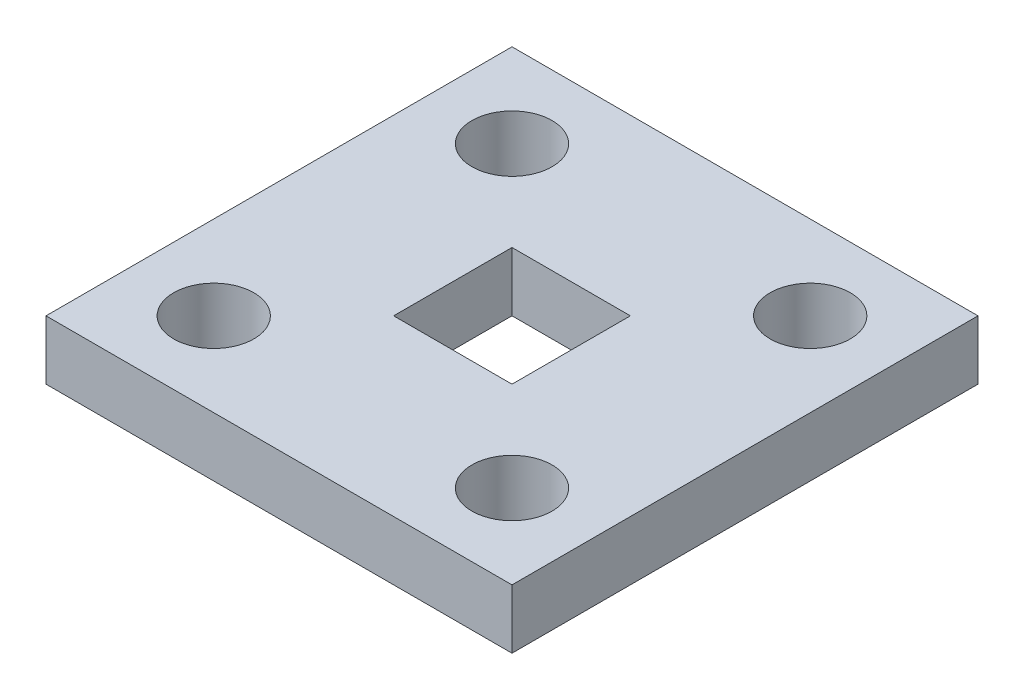
ISO-10303-21;
HEADER;
FILE_DESCRIPTION(('STEP AP214'),'2;1');
FILE_NAME('part.step','',(''),(''),'','','');
FILE_SCHEMA(('AUTOMOTIVE_DESIGN { 1 0 10303 214 1 1 1 1 }'));
ENDSEC;
DATA;
#1=APPLICATION_CONTEXT('core data for automotive mechanical design processes');
#2=APPLICATION_PROTOCOL_DEFINITION('international standard','automotive_design',2000,#1);
#3=PRODUCT_CONTEXT('',#1,'mechanical');
#4=PRODUCT('Part','Part','',(#3));
#5=PRODUCT_RELATED_PRODUCT_CATEGORY('part','',(#4));
#6=PRODUCT_DEFINITION_FORMATION('','',#4);
#7=PRODUCT_DEFINITION_CONTEXT('part definition',#1,'design');
#8=PRODUCT_DEFINITION('design','',#6,#7);
#9=PRODUCT_DEFINITION_SHAPE('','',#8);
#10=(LENGTH_UNIT() NAMED_UNIT(*) SI_UNIT(.MILLI.,.METRE.));
#11=(NAMED_UNIT(*) PLANE_ANGLE_UNIT() SI_UNIT($,.RADIAN.));
#12=(NAMED_UNIT(*) SI_UNIT($,.STERADIAN.) SOLID_ANGLE_UNIT());
#13=UNCERTAINTY_MEASURE_WITH_UNIT(LENGTH_MEASURE(1.E-05),#10,'distance_accuracy_value','');
#14=(GEOMETRIC_REPRESENTATION_CONTEXT(3) GLOBAL_UNCERTAINTY_ASSIGNED_CONTEXT((#13)) GLOBAL_UNIT_ASSIGNED_CONTEXT((#10,
#11,#12)) REPRESENTATION_CONTEXT('',''));
#15=CARTESIAN_POINT('',(0.,0.,0.));
#16=DIRECTION('',(0.,0.,1.));
#17=DIRECTION('',(1.,0.,0.));
#18=AXIS2_PLACEMENT_3D('',#15,#16,#17);
#19=CARTESIAN_POINT('',(0.,3.175,0.));
#20=DIRECTION('',(0.,-1.,0.));
#21=DIRECTION('',(0.,0.,-1.));
#22=AXIS2_PLACEMENT_3D('',#19,#20,#21);
#23=PLANE('',#22);
#24=DIRECTION('',(0.,0.,-1.));
#25=VECTOR('',#24,1.);
#26=CARTESIAN_POINT('',(12.5,3.175,12.5));
#27=LINE('',#26,#25);
#28=CARTESIAN_POINT('',(12.5,3.175,12.5));
#29=VERTEX_POINT('',#28);
#30=CARTESIAN_POINT('',(12.5,3.175,-12.5));
#31=VERTEX_POINT('',#30);
#32=EDGE_CURVE('E143',#29,#31,#27,.T.);
#33=ORIENTED_EDGE('',*,*,#32,.T.);
#34=DIRECTION('',(-1.,0.,0.));
#35=VECTOR('',#34,1.);
#36=CARTESIAN_POINT('',(-12.5,3.175,-12.5));
#37=LINE('',#36,#35);
#38=CARTESIAN_POINT('',(-12.5,3.175,-12.5));
#39=VERTEX_POINT('',#38);
#40=EDGE_CURVE('E146',#31,#39,#37,.T.);
#41=ORIENTED_EDGE('',*,*,#40,.T.);
#42=DIRECTION('',(0.,0.,1.));
#43=VECTOR('',#42,1.);
#44=CARTESIAN_POINT('',(-12.5,3.175,12.5));
#45=LINE('',#44,#43);
#46=CARTESIAN_POINT('',(-12.5,3.175,12.5));
#47=VERTEX_POINT('',#46);
#48=EDGE_CURVE('E149',#39,#47,#45,.T.);
#49=ORIENTED_EDGE('',*,*,#48,.T.);
#50=DIRECTION('',(1.,0.,0.));
#51=VECTOR('',#50,1.);
#52=CARTESIAN_POINT('',(-12.5,3.175,12.5));
#53=LINE('',#52,#51);
#54=EDGE_CURVE('E151',#47,#29,#53,.T.);
#55=ORIENTED_EDGE('',*,*,#54,.T.);
#56=EDGE_LOOP('',(#33,#41,#49,#55));
#57=FACE_BOUND('',#56,.T.);
#58=DIRECTION('',(0.,0.,-1.));
#59=VECTOR('',#58,1.);
#60=CARTESIAN_POINT('',(3.17500000000001,3.175,3.17500000000001));
#61=LINE('',#60,#59);
#62=CARTESIAN_POINT('',(3.17500000000001,3.175,3.17500000000001));
#63=VERTEX_POINT('',#62);
#64=CARTESIAN_POINT('',(3.175,3.175,-3.17499999999999));
#65=VERTEX_POINT('',#64);
#66=EDGE_CURVE('E104',#63,#65,#61,.T.);
#67=ORIENTED_EDGE('',*,*,#66,.F.);
#68=DIRECTION('',(1.,0.,0.));
#69=VECTOR('',#68,1.);
#70=CARTESIAN_POINT('',(-3.175,3.175,3.17500000000001));
#71=LINE('',#70,#69);
#72=CARTESIAN_POINT('',(-3.175,3.175,3.17500000000001));
#73=VERTEX_POINT('',#72);
#74=EDGE_CURVE('E127',#73,#63,#71,.T.);
#75=ORIENTED_EDGE('',*,*,#74,.F.);
#76=DIRECTION('',(0.,0.,1.));
#77=VECTOR('',#76,1.);
#78=CARTESIAN_POINT('',(-3.175,3.175,3.17500000000001));
#79=LINE('',#78,#77);
#80=CARTESIAN_POINT('',(-3.175,3.175,-3.175));
#81=VERTEX_POINT('',#80);
#82=EDGE_CURVE('E125',#81,#73,#79,.T.);
#83=ORIENTED_EDGE('',*,*,#82,.F.);
#84=DIRECTION('',(-1.,0.,0.));
#85=VECTOR('',#84,1.);
#86=CARTESIAN_POINT('',(-3.175,3.175,-3.175));
#87=LINE('',#86,#85);
#88=EDGE_CURVE('E112',#65,#81,#87,.T.);
#89=ORIENTED_EDGE('',*,*,#88,.F.);
#90=EDGE_LOOP('',(#67,#75,#83,#89));
#91=FACE_BOUND('',#90,.T.);
#92=CARTESIAN_POINT('',(8.,3.175,-8.));
#93=DIRECTION('',(0.,1.,0.));
#94=DIRECTION('',(0.,0.,1.));
#95=AXIS2_PLACEMENT_3D('',#92,#93,#94);
#96=CIRCLE('',#95,2.15);
#97=CARTESIAN_POINT('',(8.,3.175,-5.85));
#98=VERTEX_POINT('',#97);
#99=EDGE_CURVE('E133',#98,#98,#96,.T.);
#100=ORIENTED_EDGE('',*,*,#99,.F.);
#101=EDGE_LOOP('',(#100));
#102=FACE_BOUND('',#101,.T.);
#103=CARTESIAN_POINT('',(8.,3.175,8.));
#104=DIRECTION('',(0.,1.,0.));
#105=DIRECTION('',(0.,0.,1.));
#106=AXIS2_PLACEMENT_3D('',#103,#104,#105);
#107=CIRCLE('',#106,2.15);
#108=CARTESIAN_POINT('',(8.,3.175,10.15));
#109=VERTEX_POINT('',#108);
#110=EDGE_CURVE('E255',#109,#109,#107,.T.);
#111=ORIENTED_EDGE('',*,*,#110,.F.);
#112=EDGE_LOOP('',(#111));
#113=FACE_BOUND('',#112,.T.);
#114=CARTESIAN_POINT('',(-8.,3.175,-8.));
#115=DIRECTION('',(0.,1.,0.));
#116=DIRECTION('',(0.,0.,1.));
#117=AXIS2_PLACEMENT_3D('',#114,#115,#116);
#118=CIRCLE('',#117,2.15);
#119=CARTESIAN_POINT('',(-8.,3.175,-5.85));
#120=VERTEX_POINT('',#119);
#121=EDGE_CURVE('E249',#120,#120,#118,.T.);
#122=ORIENTED_EDGE('',*,*,#121,.F.);
#123=EDGE_LOOP('',(#122));
#124=FACE_BOUND('',#123,.T.);
#125=CARTESIAN_POINT('',(-8.,3.175,8.));
#126=DIRECTION('',(0.,1.,0.));
#127=DIRECTION('',(0.,0.,1.));
#128=AXIS2_PLACEMENT_3D('',#125,#126,#127);
#129=CIRCLE('',#128,2.15);
#130=CARTESIAN_POINT('',(-8.,3.175,10.15));
#131=VERTEX_POINT('',#130);
#132=EDGE_CURVE('E240',#131,#131,#129,.T.);
#133=ORIENTED_EDGE('',*,*,#132,.F.);
#134=EDGE_LOOP('',(#133));
#135=FACE_BOUND('',#134,.T.);
#136=ADVANCED_FACE('F39',(#57,#91,#102,#113,#124,#135),#23,.F.);
#137=CARTESIAN_POINT('',(0.,0.,0.));
#138=DIRECTION('',(0.,-1.,0.));
#139=DIRECTION('',(0.,0.,-1.));
#140=AXIS2_PLACEMENT_3D('',#137,#138,#139);
#141=PLANE('',#140);
#142=CARTESIAN_POINT('',(-8.,0.,-8.));
#143=DIRECTION('',(0.,1.,0.));
#144=DIRECTION('',(0.,0.,1.));
#145=AXIS2_PLACEMENT_3D('',#142,#143,#144);
#146=CIRCLE('',#145,2.15);
#147=CARTESIAN_POINT('',(-8.,0.,-5.85));
#148=VERTEX_POINT('',#147);
#149=EDGE_CURVE('E246',#148,#148,#146,.T.);
#150=ORIENTED_EDGE('',*,*,#149,.T.);
#151=EDGE_LOOP('',(#150));
#152=FACE_BOUND('',#151,.T.);
#153=CARTESIAN_POINT('',(8.,0.,-8.));
#154=DIRECTION('',(0.,1.,0.));
#155=DIRECTION('',(0.,0.,1.));
#156=AXIS2_PLACEMENT_3D('',#153,#154,#155);
#157=CIRCLE('',#156,2.15);
#158=CARTESIAN_POINT('',(8.,0.,-5.85));
#159=VERTEX_POINT('',#158);
#160=EDGE_CURVE('E258',#159,#159,#157,.T.);
#161=ORIENTED_EDGE('',*,*,#160,.T.);
#162=EDGE_LOOP('',(#161));
#163=FACE_BOUND('',#162,.T.);
#164=DIRECTION('',(0.,0.,-1.));
#165=VECTOR('',#164,1.);
#166=CARTESIAN_POINT('',(12.5,0.,12.5));
#167=LINE('',#166,#165);
#168=CARTESIAN_POINT('',(12.5,0.,12.5));
#169=VERTEX_POINT('',#168);
#170=CARTESIAN_POINT('',(12.5,0.,-12.5));
#171=VERTEX_POINT('',#170);
#172=EDGE_CURVE('E120',#169,#171,#167,.T.);
#173=ORIENTED_EDGE('',*,*,#172,.F.);
#174=DIRECTION('',(1.,0.,0.));
#175=VECTOR('',#174,1.);
#176=CARTESIAN_POINT('',(-12.5,0.,12.5));
#177=LINE('',#176,#175);
#178=CARTESIAN_POINT('',(-12.5,0.,12.5));
#179=VERTEX_POINT('',#178);
#180=EDGE_CURVE('E147',#179,#169,#177,.T.);
#181=ORIENTED_EDGE('',*,*,#180,.F.);
#182=DIRECTION('',(0.,0.,1.));
#183=VECTOR('',#182,1.);
#184=CARTESIAN_POINT('',(-12.5,0.,12.5));
#185=LINE('',#184,#183);
#186=CARTESIAN_POINT('',(-12.5,0.,-12.5));
#187=VERTEX_POINT('',#186);
#188=EDGE_CURVE('E158',#187,#179,#185,.T.);
#189=ORIENTED_EDGE('',*,*,#188,.F.);
#190=DIRECTION('',(-1.,0.,0.));
#191=VECTOR('',#190,1.);
#192=CARTESIAN_POINT('',(-12.5,0.,-12.5));
#193=LINE('',#192,#191);
#194=EDGE_CURVE('E156',#171,#187,#193,.T.);
#195=ORIENTED_EDGE('',*,*,#194,.F.);
#196=EDGE_LOOP('',(#173,#181,#189,#195));
#197=FACE_BOUND('',#196,.T.);
#198=DIRECTION('',(1.,0.,0.));
#199=VECTOR('',#198,1.);
#200=CARTESIAN_POINT('',(-3.175,0.,3.17500000000001));
#201=LINE('',#200,#199);
#202=CARTESIAN_POINT('',(-3.175,0.,3.17500000000001));
#203=VERTEX_POINT('',#202);
#204=CARTESIAN_POINT('',(3.17500000000001,0.,3.17500000000001));
#205=VERTEX_POINT('',#204);
#206=EDGE_CURVE('E113',#203,#205,#201,.T.);
#207=ORIENTED_EDGE('',*,*,#206,.T.);
#208=DIRECTION('',(0.,0.,-1.));
#209=VECTOR('',#208,1.);
#210=CARTESIAN_POINT('',(3.17500000000001,0.,3.17500000000001));
#211=LINE('',#210,#209);
#212=CARTESIAN_POINT('',(3.175,0.,-3.17499999999999));
#213=VERTEX_POINT('',#212);
#214=EDGE_CURVE('E62',#205,#213,#211,.T.);
#215=ORIENTED_EDGE('',*,*,#214,.T.);
#216=DIRECTION('',(-1.,0.,0.));
#217=VECTOR('',#216,1.);
#218=CARTESIAN_POINT('',(-3.175,0.,-3.175));
#219=LINE('',#218,#217);
#220=CARTESIAN_POINT('',(-3.175,0.,-3.175));
#221=VERTEX_POINT('',#220);
#222=EDGE_CURVE('E119',#213,#221,#219,.T.);
#223=ORIENTED_EDGE('',*,*,#222,.T.);
#224=DIRECTION('',(0.,0.,1.));
#225=VECTOR('',#224,1.);
#226=CARTESIAN_POINT('',(-3.175,0.,3.17500000000001));
#227=LINE('',#226,#225);
#228=EDGE_CURVE('E135',#221,#203,#227,.T.);
#229=ORIENTED_EDGE('',*,*,#228,.T.);
#230=EDGE_LOOP('',(#207,#215,#223,#229));
#231=FACE_BOUND('',#230,.T.);
#232=CARTESIAN_POINT('',(8.,0.,8.));
#233=DIRECTION('',(0.,1.,0.));
#234=DIRECTION('',(0.,0.,1.));
#235=AXIS2_PLACEMENT_3D('',#232,#233,#234);
#236=CIRCLE('',#235,2.15);
#237=CARTESIAN_POINT('',(8.,0.,10.15));
#238=VERTEX_POINT('',#237);
#239=EDGE_CURVE('E252',#238,#238,#236,.T.);
#240=ORIENTED_EDGE('',*,*,#239,.T.);
#241=EDGE_LOOP('',(#240));
#242=FACE_BOUND('',#241,.T.);
#243=CARTESIAN_POINT('',(-8.,0.,8.));
#244=DIRECTION('',(0.,1.,0.));
#245=DIRECTION('',(0.,0.,1.));
#246=AXIS2_PLACEMENT_3D('',#243,#244,#245);
#247=CIRCLE('',#246,2.15);
#248=CARTESIAN_POINT('',(-8.,0.,10.15));
#249=VERTEX_POINT('',#248);
#250=EDGE_CURVE('E243',#249,#249,#247,.T.);
#251=ORIENTED_EDGE('',*,*,#250,.T.);
#252=EDGE_LOOP('',(#251));
#253=FACE_BOUND('',#252,.T.);
#254=ADVANCED_FACE('F176',(#152,#163,#197,#231,#242,#253),#141,.T.);
#255=CARTESIAN_POINT('',(12.5,3.175,12.5));
#256=DIRECTION('',(-1.,0.,0.));
#257=DIRECTION('',(0.,0.,1.));
#258=AXIS2_PLACEMENT_3D('',#255,#256,#257);
#259=PLANE('',#258);
#260=ORIENTED_EDGE('',*,*,#172,.T.);
#261=DIRECTION('',(0.,-1.,0.));
#262=VECTOR('',#261,1.);
#263=CARTESIAN_POINT('',(12.5,3.175,-12.5));
#264=LINE('',#263,#262);
#265=EDGE_CURVE('E11',#31,#171,#264,.T.);
#266=ORIENTED_EDGE('',*,*,#265,.F.);
#267=ORIENTED_EDGE('',*,*,#32,.F.);
#268=DIRECTION('',(0.,-1.,0.));
#269=VECTOR('',#268,1.);
#270=CARTESIAN_POINT('',(12.5,3.175,12.5));
#271=LINE('',#270,#269);
#272=EDGE_CURVE('E153',#29,#169,#271,.T.);
#273=ORIENTED_EDGE('',*,*,#272,.T.);
#274=EDGE_LOOP('',(#260,#266,#267,#273));
#275=FACE_BOUND('',#274,.T.);
#276=ADVANCED_FACE('F41',(#275),#259,.F.);
#277=CARTESIAN_POINT('',(-12.5,3.175,-12.5));
#278=DIRECTION('',(0.,0.,1.));
#279=DIRECTION('',(1.,0.,0.));
#280=AXIS2_PLACEMENT_3D('',#277,#278,#279);
#281=PLANE('',#280);
#282=ORIENTED_EDGE('',*,*,#194,.T.);
#283=DIRECTION('',(0.,-1.,0.));
#284=VECTOR('',#283,1.);
#285=CARTESIAN_POINT('',(-12.5,3.175,-12.5));
#286=LINE('',#285,#284);
#287=EDGE_CURVE('E47',#39,#187,#286,.T.);
#288=ORIENTED_EDGE('',*,*,#287,.F.);
#289=ORIENTED_EDGE('',*,*,#40,.F.);
#290=ORIENTED_EDGE('',*,*,#265,.T.);
#291=EDGE_LOOP('',(#282,#288,#289,#290));
#292=FACE_BOUND('',#291,.T.);
#293=ADVANCED_FACE('F186',(#292),#281,.F.);
#294=CARTESIAN_POINT('',(-12.5,3.175,12.5));
#295=DIRECTION('',(1.,0.,0.));
#296=DIRECTION('',(0.,0.,-1.));
#297=AXIS2_PLACEMENT_3D('',#294,#295,#296);
#298=PLANE('',#297);
#299=ORIENTED_EDGE('',*,*,#188,.T.);
#300=DIRECTION('',(0.,-1.,0.));
#301=VECTOR('',#300,1.);
#302=CARTESIAN_POINT('',(-12.5,3.175,12.5));
#303=LINE('',#302,#301);
#304=EDGE_CURVE('E163',#47,#179,#303,.T.);
#305=ORIENTED_EDGE('',*,*,#304,.F.);
#306=ORIENTED_EDGE('',*,*,#48,.F.);
#307=ORIENTED_EDGE('',*,*,#287,.T.);
#308=EDGE_LOOP('',(#299,#305,#306,#307));
#309=FACE_BOUND('',#308,.T.);
#310=ADVANCED_FACE('F170',(#309),#298,.F.);
#311=CARTESIAN_POINT('',(-12.5,3.175,12.5));
#312=DIRECTION('',(0.,0.,-1.));
#313=DIRECTION('',(-1.,0.,0.));
#314=AXIS2_PLACEMENT_3D('',#311,#312,#313);
#315=PLANE('',#314);
#316=ORIENTED_EDGE('',*,*,#180,.T.);
#317=ORIENTED_EDGE('',*,*,#272,.F.);
#318=ORIENTED_EDGE('',*,*,#54,.F.);
#319=ORIENTED_EDGE('',*,*,#304,.T.);
#320=EDGE_LOOP('',(#316,#317,#318,#319));
#321=FACE_BOUND('',#320,.T.);
#322=ADVANCED_FACE('F180',(#321),#315,.F.);
#323=CARTESIAN_POINT('',(3.17500000000001,3.175,3.17500000000001));
#324=DIRECTION('',(-1.,0.,0.));
#325=DIRECTION('',(0.,0.,1.));
#326=AXIS2_PLACEMENT_3D('',#323,#324,#325);
#327=PLANE('',#326);
#328=ORIENTED_EDGE('',*,*,#214,.F.);
#329=DIRECTION('',(0.,-1.,0.));
#330=VECTOR('',#329,1.);
#331=CARTESIAN_POINT('',(3.17500000000001,3.175,3.17500000000001));
#332=LINE('',#331,#330);
#333=EDGE_CURVE('E108',#63,#205,#332,.T.);
#334=ORIENTED_EDGE('',*,*,#333,.F.);
#335=ORIENTED_EDGE('',*,*,#66,.T.);
#336=DIRECTION('',(0.,-1.,0.));
#337=VECTOR('',#336,1.);
#338=CARTESIAN_POINT('',(3.175,3.175,-3.17499999999999));
#339=LINE('',#338,#337);
#340=EDGE_CURVE('E107',#65,#213,#339,.T.);
#341=ORIENTED_EDGE('',*,*,#340,.T.);
#342=EDGE_LOOP('',(#328,#334,#335,#341));
#343=FACE_BOUND('',#342,.T.);
#344=ADVANCED_FACE('F106',(#343),#327,.T.);
#345=CARTESIAN_POINT('',(-3.175,3.175,-3.175));
#346=DIRECTION('',(0.,0.,1.));
#347=DIRECTION('',(1.,0.,0.));
#348=AXIS2_PLACEMENT_3D('',#345,#346,#347);
#349=PLANE('',#348);
#350=ORIENTED_EDGE('',*,*,#222,.F.);
#351=ORIENTED_EDGE('',*,*,#340,.F.);
#352=ORIENTED_EDGE('',*,*,#88,.T.);
#353=DIRECTION('',(0.,-1.,0.));
#354=VECTOR('',#353,1.);
#355=CARTESIAN_POINT('',(-3.175,3.175,-3.175));
#356=LINE('',#355,#354);
#357=EDGE_CURVE('E121',#81,#221,#356,.T.);
#358=ORIENTED_EDGE('',*,*,#357,.T.);
#359=EDGE_LOOP('',(#350,#351,#352,#358));
#360=FACE_BOUND('',#359,.T.);
#361=ADVANCED_FACE('F116',(#360),#349,.T.);
#362=CARTESIAN_POINT('',(-3.175,3.175,3.17500000000001));
#363=DIRECTION('',(1.,0.,0.));
#364=DIRECTION('',(0.,0.,-1.));
#365=AXIS2_PLACEMENT_3D('',#362,#363,#364);
#366=PLANE('',#365);
#367=ORIENTED_EDGE('',*,*,#228,.F.);
#368=ORIENTED_EDGE('',*,*,#357,.F.);
#369=ORIENTED_EDGE('',*,*,#82,.T.);
#370=DIRECTION('',(0.,-1.,0.));
#371=VECTOR('',#370,1.);
#372=CARTESIAN_POINT('',(-3.175,3.175,3.17500000000001));
#373=LINE('',#372,#371);
#374=EDGE_CURVE('E54',#73,#203,#373,.T.);
#375=ORIENTED_EDGE('',*,*,#374,.T.);
#376=EDGE_LOOP('',(#367,#368,#369,#375));
#377=FACE_BOUND('',#376,.T.);
#378=ADVANCED_FACE('F210',(#377),#366,.T.);
#379=CARTESIAN_POINT('',(-3.175,3.175,3.17500000000001));
#380=DIRECTION('',(0.,0.,-1.));
#381=DIRECTION('',(-1.,0.,0.));
#382=AXIS2_PLACEMENT_3D('',#379,#380,#381);
#383=PLANE('',#382);
#384=ORIENTED_EDGE('',*,*,#206,.F.);
#385=ORIENTED_EDGE('',*,*,#374,.F.);
#386=ORIENTED_EDGE('',*,*,#74,.T.);
#387=ORIENTED_EDGE('',*,*,#333,.T.);
#388=EDGE_LOOP('',(#384,#385,#386,#387));
#389=FACE_BOUND('',#388,.T.);
#390=ADVANCED_FACE('F214',(#389),#383,.T.);
#391=CARTESIAN_POINT('',(8.,3.175,-8.));
#392=DIRECTION('',(0.,-1.,0.));
#393=DIRECTION('',(0.,0.,-1.));
#394=AXIS2_PLACEMENT_3D('',#391,#392,#393);
#395=CYLINDRICAL_SURFACE('',#394,2.15);
#396=ORIENTED_EDGE('',*,*,#99,.T.);
#397=EDGE_LOOP('',(#396));
#398=FACE_BOUND('',#397,.T.);
#399=ORIENTED_EDGE('',*,*,#160,.F.);
#400=EDGE_LOOP('',(#399));
#401=FACE_BOUND('',#400,.T.);
#402=ADVANCED_FACE('F220',(#398,#401),#395,.F.);
#403=CARTESIAN_POINT('',(8.,3.175,8.));
#404=DIRECTION('',(0.,-1.,0.));
#405=DIRECTION('',(0.,0.,-1.));
#406=AXIS2_PLACEMENT_3D('',#403,#404,#405);
#407=CYLINDRICAL_SURFACE('',#406,2.15);
#408=ORIENTED_EDGE('',*,*,#110,.T.);
#409=EDGE_LOOP('',(#408));
#410=FACE_BOUND('',#409,.T.);
#411=ORIENTED_EDGE('',*,*,#239,.F.);
#412=EDGE_LOOP('',(#411));
#413=FACE_BOUND('',#412,.T.);
#414=ADVANCED_FACE('F223',(#410,#413),#407,.F.);
#415=CARTESIAN_POINT('',(-8.,3.175,-8.));
#416=DIRECTION('',(0.,-1.,0.));
#417=DIRECTION('',(0.,0.,-1.));
#418=AXIS2_PLACEMENT_3D('',#415,#416,#417);
#419=CYLINDRICAL_SURFACE('',#418,2.15);
#420=ORIENTED_EDGE('',*,*,#121,.T.);
#421=EDGE_LOOP('',(#420));
#422=FACE_BOUND('',#421,.T.);
#423=ORIENTED_EDGE('',*,*,#149,.F.);
#424=EDGE_LOOP('',(#423));
#425=FACE_BOUND('',#424,.T.);
#426=ADVANCED_FACE('F227',(#422,#425),#419,.F.);
#427=CARTESIAN_POINT('',(-8.,3.175,8.));
#428=DIRECTION('',(0.,-1.,0.));
#429=DIRECTION('',(0.,0.,-1.));
#430=AXIS2_PLACEMENT_3D('',#427,#428,#429);
#431=CYLINDRICAL_SURFACE('',#430,2.15);
#432=ORIENTED_EDGE('',*,*,#132,.T.);
#433=EDGE_LOOP('',(#432));
#434=FACE_BOUND('',#433,.T.);
#435=ORIENTED_EDGE('',*,*,#250,.F.);
#436=EDGE_LOOP('',(#435));
#437=FACE_BOUND('',#436,.T.);
#438=ADVANCED_FACE('F231',(#434,#437),#431,.F.);
#439=CLOSED_SHELL('',(#136,#254,#276,#293,#310,#322,#344,#361,#378,#390,#402,#414,#426,#438));
#440=MANIFOLD_SOLID_BREP('B2',#439);
#441=ADVANCED_BREP_SHAPE_REPRESENTATION('',(#18,#440),#14);
#442=SHAPE_DEFINITION_REPRESENTATION(#9,#441);
ENDSEC;
END-ISO-10303-21;
